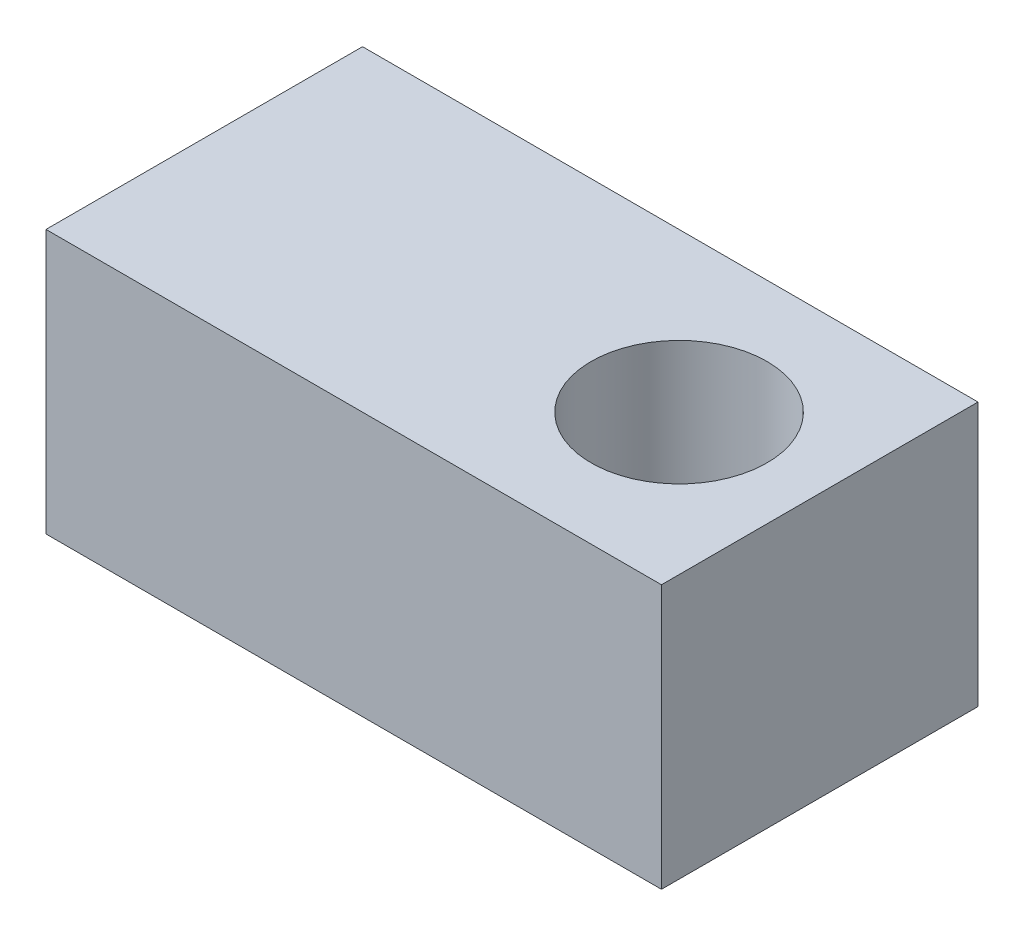
ISO-10303-21;
HEADER;
FILE_DESCRIPTION(('STEP AP214'),'2;1');
FILE_NAME('part.step','',(''),(''),'','','');
FILE_SCHEMA(('AUTOMOTIVE_DESIGN { 1 0 10303 214 1 1 1 1 }'));
ENDSEC;
DATA;
#1=APPLICATION_CONTEXT('core data for automotive mechanical design processes');
#2=APPLICATION_PROTOCOL_DEFINITION('international standard','automotive_design',2000,#1);
#3=PRODUCT_CONTEXT('',#1,'mechanical');
#4=PRODUCT('Part','Part','',(#3));
#5=PRODUCT_RELATED_PRODUCT_CATEGORY('part','',(#4));
#6=PRODUCT_DEFINITION_FORMATION('','',#4);
#7=PRODUCT_DEFINITION_CONTEXT('part definition',#1,'design');
#8=PRODUCT_DEFINITION('design','',#6,#7);
#9=PRODUCT_DEFINITION_SHAPE('','',#8);
#10=(LENGTH_UNIT() NAMED_UNIT(*) SI_UNIT(.MILLI.,.METRE.));
#11=(NAMED_UNIT(*) PLANE_ANGLE_UNIT() SI_UNIT($,.RADIAN.));
#12=(NAMED_UNIT(*) SI_UNIT($,.STERADIAN.) SOLID_ANGLE_UNIT());
#13=UNCERTAINTY_MEASURE_WITH_UNIT(LENGTH_MEASURE(1.E-05),#10,'distance_accuracy_value','');
#14=(GEOMETRIC_REPRESENTATION_CONTEXT(3) GLOBAL_UNCERTAINTY_ASSIGNED_CONTEXT((#13)) GLOBAL_UNIT_ASSIGNED_CONTEXT((#10,
#11,#12)) REPRESENTATION_CONTEXT('',''));
#15=CARTESIAN_POINT('',(0.,0.,0.));
#16=DIRECTION('',(0.,0.,1.));
#17=DIRECTION('',(1.,0.,0.));
#18=AXIS2_PLACEMENT_3D('',#15,#16,#17);
#19=CARTESIAN_POINT('',(35.,12.9130434782609,27.7826086956522));
#20=DIRECTION('',(0.,0.,-1.));
#21=DIRECTION('',(0.,1.,0.));
#22=AXIS2_PLACEMENT_3D('',#19,#20,#21);
#23=PLANE('',#22);
#24=DIRECTION('',(0.,-1.,0.));
#25=VECTOR('',#24,1.);
#26=CARTESIAN_POINT('',(0.,12.9130434782609,27.7826086956522));
#27=LINE('',#26,#25);
#28=CARTESIAN_POINT('',(0.,12.9130434782609,27.7826086956522));
#29=VERTEX_POINT('',#28);
#30=CARTESIAN_POINT('',(0.,-2.0869565217391,27.7826086956522));
#31=VERTEX_POINT('',#30);
#32=EDGE_CURVE('E103',#29,#31,#27,.T.);
#33=ORIENTED_EDGE('',*,*,#32,.T.);
#34=DIRECTION('',(-1.,0.,0.));
#35=VECTOR('',#34,1.);
#36=CARTESIAN_POINT('',(35.,-2.0869565217391,27.7826086956522));
#37=LINE('',#36,#35);
#38=CARTESIAN_POINT('',(35.,-2.0869565217391,27.7826086956522));
#39=VERTEX_POINT('',#38);
#40=EDGE_CURVE('E11',#39,#31,#37,.T.);
#41=ORIENTED_EDGE('',*,*,#40,.F.);
#42=DIRECTION('',(0.,-1.,0.));
#43=VECTOR('',#42,1.);
#44=CARTESIAN_POINT('',(35.,12.9130434782609,27.7826086956522));
#45=LINE('',#44,#43);
#46=CARTESIAN_POINT('',(35.,12.9130434782609,27.7826086956522));
#47=VERTEX_POINT('',#46);
#48=EDGE_CURVE('E91',#47,#39,#45,.T.);
#49=ORIENTED_EDGE('',*,*,#48,.F.);
#50=DIRECTION('',(-1.,0.,0.));
#51=VECTOR('',#50,1.);
#52=CARTESIAN_POINT('',(35.,12.9130434782609,27.7826086956522));
#53=LINE('',#52,#51);
#54=EDGE_CURVE('E99',#47,#29,#53,.T.);
#55=ORIENTED_EDGE('',*,*,#54,.T.);
#56=EDGE_LOOP('',(#33,#41,#49,#55));
#57=FACE_BOUND('',#56,.T.);
#58=ADVANCED_FACE('F40',(#57),#23,.F.);
#59=CARTESIAN_POINT('',(35.,-2.0869565217391,27.7826086956522));
#60=DIRECTION('',(0.,1.,0.));
#61=DIRECTION('',(0.,0.,1.));
#62=AXIS2_PLACEMENT_3D('',#59,#60,#61);
#63=PLANE('',#62);
#64=CARTESIAN_POINT('',(27.,-2.0869565217391,18.7826086956522));
#65=DIRECTION('',(0.,-1.,0.));
#66=DIRECTION('',(0.,0.,-1.));
#67=AXIS2_PLACEMENT_3D('',#64,#65,#66);
#68=CIRCLE('',#67,5.);
#69=CARTESIAN_POINT('',(27.,-2.0869565217391,13.7826086956522));
#70=VERTEX_POINT('',#69);
#71=EDGE_CURVE('E117',#70,#70,#68,.T.);
#72=ORIENTED_EDGE('',*,*,#71,.F.);
#73=EDGE_LOOP('',(#72));
#74=FACE_BOUND('',#73,.T.);
#75=DIRECTION('',(0.,0.,-1.));
#76=VECTOR('',#75,1.);
#77=CARTESIAN_POINT('',(0.,-2.0869565217391,27.7826086956522));
#78=LINE('',#77,#76);
#79=CARTESIAN_POINT('',(0.,-2.0869565217391,9.78260869565219));
#80=VERTEX_POINT('',#79);
#81=EDGE_CURVE('E95',#31,#80,#78,.T.);
#82=ORIENTED_EDGE('',*,*,#81,.T.);
#83=DIRECTION('',(-1.,0.,0.));
#84=VECTOR('',#83,1.);
#85=CARTESIAN_POINT('',(35.,-2.0869565217391,9.78260869565219));
#86=LINE('',#85,#84);
#87=CARTESIAN_POINT('',(35.,-2.0869565217391,9.78260869565219));
#88=VERTEX_POINT('',#87);
#89=EDGE_CURVE('E48',#88,#80,#86,.T.);
#90=ORIENTED_EDGE('',*,*,#89,.F.);
#91=DIRECTION('',(0.,0.,-1.));
#92=VECTOR('',#91,1.);
#93=CARTESIAN_POINT('',(35.,-2.0869565217391,27.7826086956522));
#94=LINE('',#93,#92);
#95=EDGE_CURVE('E86',#39,#88,#94,.T.);
#96=ORIENTED_EDGE('',*,*,#95,.F.);
#97=ORIENTED_EDGE('',*,*,#40,.T.);
#98=EDGE_LOOP('',(#82,#90,#96,#97));
#99=FACE_BOUND('',#98,.T.);
#100=ADVANCED_FACE('F94',(#74,#99),#63,.F.);
#101=CARTESIAN_POINT('',(35.,12.9130434782609,9.7826086956522));
#102=DIRECTION('',(0.,0.,1.));
#103=DIRECTION('',(0.,-1.,0.));
#104=AXIS2_PLACEMENT_3D('',#101,#102,#103);
#105=PLANE('',#104);
#106=DIRECTION('',(0.,1.,0.));
#107=VECTOR('',#106,1.);
#108=CARTESIAN_POINT('',(0.,12.9130434782609,9.7826086956522));
#109=LINE('',#108,#107);
#110=CARTESIAN_POINT('',(0.,12.9130434782609,9.7826086956522));
#111=VERTEX_POINT('',#110);
#112=EDGE_CURVE('E73',#80,#111,#109,.T.);
#113=ORIENTED_EDGE('',*,*,#112,.T.);
#114=DIRECTION('',(-1.,0.,0.));
#115=VECTOR('',#114,1.);
#116=CARTESIAN_POINT('',(35.,12.9130434782609,9.7826086956522));
#117=LINE('',#116,#115);
#118=CARTESIAN_POINT('',(35.,12.9130434782609,9.7826086956522));
#119=VERTEX_POINT('',#118);
#120=EDGE_CURVE('E96',#119,#111,#117,.T.);
#121=ORIENTED_EDGE('',*,*,#120,.F.);
#122=DIRECTION('',(0.,1.,0.));
#123=VECTOR('',#122,1.);
#124=CARTESIAN_POINT('',(35.,12.9130434782609,9.7826086956522));
#125=LINE('',#124,#123);
#126=EDGE_CURVE('E89',#88,#119,#125,.T.);
#127=ORIENTED_EDGE('',*,*,#126,.F.);
#128=ORIENTED_EDGE('',*,*,#89,.T.);
#129=EDGE_LOOP('',(#113,#121,#127,#128));
#130=FACE_BOUND('',#129,.T.);
#131=ADVANCED_FACE('F97',(#130),#105,.F.);
#132=CARTESIAN_POINT('',(35.,12.9130434782609,27.7826086956522));
#133=DIRECTION('',(0.,-1.,0.));
#134=DIRECTION('',(0.,0.,-1.));
#135=AXIS2_PLACEMENT_3D('',#132,#133,#134);
#136=PLANE('',#135);
#137=CARTESIAN_POINT('',(27.,12.9130434782609,18.7826086956522));
#138=DIRECTION('',(0.,-1.,0.));
#139=DIRECTION('',(0.,0.,-1.));
#140=AXIS2_PLACEMENT_3D('',#137,#138,#139);
#141=CIRCLE('',#140,5.);
#142=CARTESIAN_POINT('',(27.,12.9130434782609,13.7826086956522));
#143=VERTEX_POINT('',#142);
#144=EDGE_CURVE('E106',#143,#143,#141,.T.);
#145=ORIENTED_EDGE('',*,*,#144,.T.);
#146=EDGE_LOOP('',(#145));
#147=FACE_BOUND('',#146,.T.);
#148=DIRECTION('',(0.,0.,1.));
#149=VECTOR('',#148,1.);
#150=CARTESIAN_POINT('',(0.,12.9130434782609,27.7826086956522));
#151=LINE('',#150,#149);
#152=EDGE_CURVE('E79',#111,#29,#151,.T.);
#153=ORIENTED_EDGE('',*,*,#152,.T.);
#154=ORIENTED_EDGE('',*,*,#54,.F.);
#155=DIRECTION('',(0.,0.,1.));
#156=VECTOR('',#155,1.);
#157=CARTESIAN_POINT('',(35.,12.9130434782609,27.7826086956522));
#158=LINE('',#157,#156);
#159=EDGE_CURVE('E56',#119,#47,#158,.T.);
#160=ORIENTED_EDGE('',*,*,#159,.F.);
#161=ORIENTED_EDGE('',*,*,#120,.T.);
#162=EDGE_LOOP('',(#153,#154,#160,#161));
#163=FACE_BOUND('',#162,.T.);
#164=ADVANCED_FACE('F111',(#147,#163),#136,.F.);
#165=CARTESIAN_POINT('',(35.,0.,0.));
#166=DIRECTION('',(1.,0.,0.));
#167=DIRECTION('',(0.,0.,-1.));
#168=AXIS2_PLACEMENT_3D('',#165,#166,#167);
#169=PLANE('',#168);
#170=ORIENTED_EDGE('',*,*,#48,.T.);
#171=ORIENTED_EDGE('',*,*,#95,.T.);
#172=ORIENTED_EDGE('',*,*,#126,.T.);
#173=ORIENTED_EDGE('',*,*,#159,.T.);
#174=EDGE_LOOP('',(#170,#171,#172,#173));
#175=FACE_BOUND('',#174,.T.);
#176=ADVANCED_FACE('F87',(#175),#169,.T.);
#177=CARTESIAN_POINT('',(0.,0.,0.));
#178=DIRECTION('',(1.,0.,0.));
#179=DIRECTION('',(0.,0.,-1.));
#180=AXIS2_PLACEMENT_3D('',#177,#178,#179);
#181=PLANE('',#180);
#182=CARTESIAN_POINT('',(0.,5.4130434782609,18.7826086956522));
#183=DIRECTION('',(-1.,0.,0.));
#184=DIRECTION('',(0.,0.,1.));
#185=AXIS2_PLACEMENT_3D('',#182,#183,#184);
#186=CIRCLE('',#185,3.);
#187=CARTESIAN_POINT('',(0.,5.4130434782609,21.7826086956522));
#188=VERTEX_POINT('',#187);
#189=EDGE_CURVE('E123',#188,#188,#186,.T.);
#190=ORIENTED_EDGE('',*,*,#189,.F.);
#191=EDGE_LOOP('',(#190));
#192=FACE_BOUND('',#191,.T.);
#193=ORIENTED_EDGE('',*,*,#32,.F.);
#194=ORIENTED_EDGE('',*,*,#152,.F.);
#195=ORIENTED_EDGE('',*,*,#112,.F.);
#196=ORIENTED_EDGE('',*,*,#81,.F.);
#197=EDGE_LOOP('',(#193,#194,#195,#196));
#198=FACE_BOUND('',#197,.T.);
#199=ADVANCED_FACE('F114',(#192,#198),#181,.F.);
#200=CARTESIAN_POINT('',(27.,12.9130434782609,18.7826086956522));
#201=DIRECTION('',(0.,-1.,0.));
#202=DIRECTION('',(0.,0.,-1.));
#203=AXIS2_PLACEMENT_3D('',#200,#201,#202);
#204=CYLINDRICAL_SURFACE('',#203,5.);
#205=ORIENTED_EDGE('',*,*,#144,.F.);
#206=EDGE_LOOP('',(#205));
#207=FACE_BOUND('',#206,.T.);
#208=ORIENTED_EDGE('',*,*,#71,.T.);
#209=EDGE_LOOP('',(#208));
#210=FACE_BOUND('',#209,.T.);
#211=ADVANCED_FACE('F134',(#207,#210),#204,.F.);
#212=CARTESIAN_POINT('',(8.,5.4130434782609,18.7826086956522));
#213=DIRECTION('',(-1.,0.,0.));
#214=DIRECTION('',(0.,0.,1.));
#215=AXIS2_PLACEMENT_3D('',#212,#213,#214);
#216=CYLINDRICAL_SURFACE('',#215,3.);
#217=CARTESIAN_POINT('',(8.,5.4130434782609,18.7826086956522));
#218=DIRECTION('',(-1.,0.,0.));
#219=DIRECTION('',(0.,0.,1.));
#220=AXIS2_PLACEMENT_3D('',#217,#218,#219);
#221=CIRCLE('',#220,3.);
#222=CARTESIAN_POINT('',(8.,5.4130434782609,21.7826086956522));
#223=VERTEX_POINT('',#222);
#224=EDGE_CURVE('E120',#223,#223,#221,.T.);
#225=ORIENTED_EDGE('',*,*,#224,.F.);
#226=EDGE_LOOP('',(#225));
#227=FACE_BOUND('',#226,.T.);
#228=ORIENTED_EDGE('',*,*,#189,.T.);
#229=EDGE_LOOP('',(#228));
#230=FACE_BOUND('',#229,.T.);
#231=ADVANCED_FACE('F131',(#227,#230),#216,.F.);
#232=CARTESIAN_POINT('',(8.,5.4130434782609,18.7826086956522));
#233=DIRECTION('',(-1.,0.,0.));
#234=DIRECTION('',(0.,0.,1.));
#235=AXIS2_PLACEMENT_3D('',#232,#233,#234);
#236=PLANE('',#235);
#237=ORIENTED_EDGE('',*,*,#224,.T.);
#238=EDGE_LOOP('',(#237));
#239=FACE_BOUND('',#238,.T.);
#240=ADVANCED_FACE('F129',(#239),#236,.T.);
#241=CLOSED_SHELL('',(#58,#100,#131,#164,#176,#199,#211,#231,#240));
#242=MANIFOLD_SOLID_BREP('B2',#241);
#243=ADVANCED_BREP_SHAPE_REPRESENTATION('',(#18,#242),#14);
#244=SHAPE_DEFINITION_REPRESENTATION(#9,#243);
ENDSEC;
END-ISO-10303-21;
